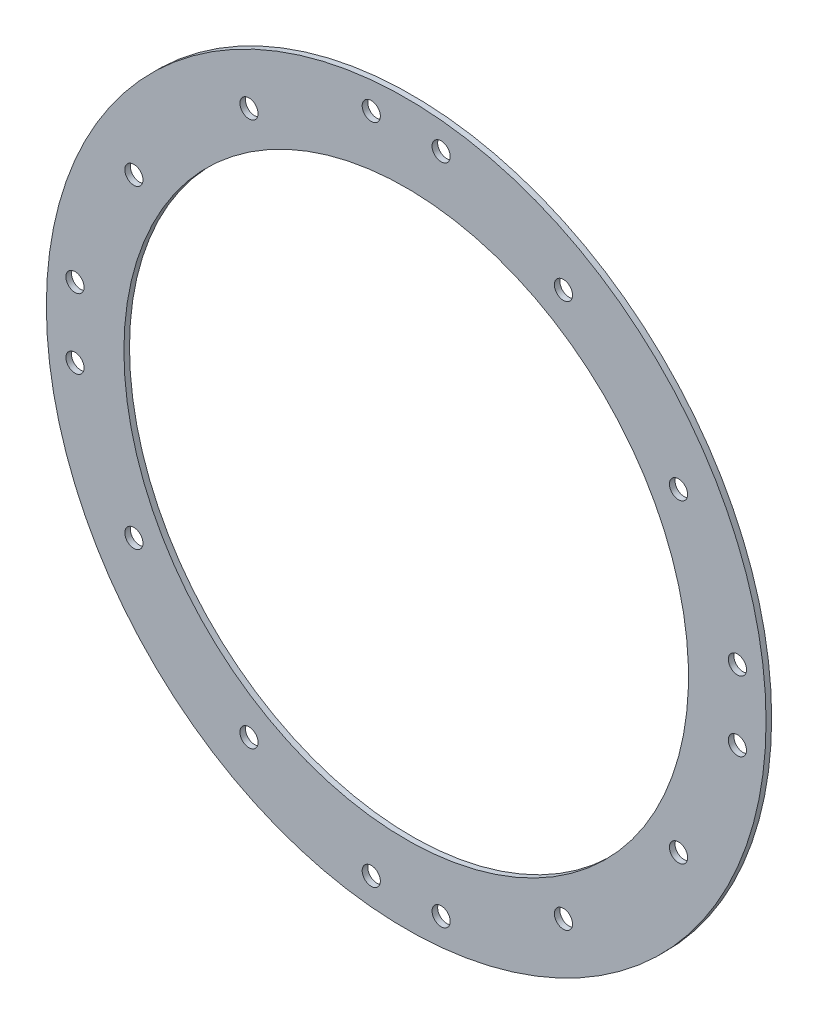
ISO-10303-21;
HEADER;
FILE_DESCRIPTION(('STEP AP214'),'2;1');
FILE_NAME('part.step','',(''),(''),'','','');
FILE_SCHEMA(('AUTOMOTIVE_DESIGN { 1 0 10303 214 1 1 1 1 }'));
ENDSEC;
DATA;
#1=APPLICATION_CONTEXT('core data for automotive mechanical design processes');
#2=APPLICATION_PROTOCOL_DEFINITION('international standard','automotive_design',2000,#1);
#3=PRODUCT_CONTEXT('',#1,'mechanical');
#4=PRODUCT('Part','Part','',(#3));
#5=PRODUCT_RELATED_PRODUCT_CATEGORY('part','',(#4));
#6=PRODUCT_DEFINITION_FORMATION('','',#4);
#7=PRODUCT_DEFINITION_CONTEXT('part definition',#1,'design');
#8=PRODUCT_DEFINITION('design','',#6,#7);
#9=PRODUCT_DEFINITION_SHAPE('','',#8);
#10=(LENGTH_UNIT() NAMED_UNIT(*) SI_UNIT(.MILLI.,.METRE.));
#11=(NAMED_UNIT(*) PLANE_ANGLE_UNIT() SI_UNIT($,.RADIAN.));
#12=(NAMED_UNIT(*) SI_UNIT($,.STERADIAN.) SOLID_ANGLE_UNIT());
#13=UNCERTAINTY_MEASURE_WITH_UNIT(LENGTH_MEASURE(1.E-05),#10,'distance_accuracy_value','');
#14=(GEOMETRIC_REPRESENTATION_CONTEXT(3) GLOBAL_UNCERTAINTY_ASSIGNED_CONTEXT((#13)) GLOBAL_UNIT_ASSIGNED_CONTEXT((#10,
#11,#12)) REPRESENTATION_CONTEXT('',''));
#15=CARTESIAN_POINT('',(0.,0.,0.));
#16=DIRECTION('',(0.,0.,1.));
#17=DIRECTION('',(1.,0.,0.));
#18=AXIS2_PLACEMENT_3D('',#15,#16,#17);
#19=CARTESIAN_POINT('',(0.,0.,-574.));
#20=DIRECTION('',(0.,0.,-1.));
#21=DIRECTION('',(-1.,0.,0.));
#22=AXIS2_PLACEMENT_3D('',#19,#20,#21);
#23=PLANE('',#22);
#24=CARTESIAN_POINT('',(-112.499999999999,194.855715851499,-574.));
#25=DIRECTION('',(0.,0.,-1.));
#26=DIRECTION('',(-1.,0.,0.));
#27=AXIS2_PLACEMENT_3D('',#24,#25,#26);
#28=CIRCLE('',#27,6.50000000000001);
#29=CARTESIAN_POINT('',(-118.999999999999,194.855715851499,-574.));
#30=VERTEX_POINT('',#29);
#31=EDGE_CURVE('E149',#30,#30,#28,.T.);
#32=ORIENTED_EDGE('',*,*,#31,.F.);
#33=EDGE_LOOP('',(#32));
#34=FACE_BOUND('',#33,.T.);
#35=CARTESIAN_POINT('',(-194.855715851499,112.5,-574.));
#36=DIRECTION('',(0.,0.,-1.));
#37=DIRECTION('',(-1.,0.,0.));
#38=AXIS2_PLACEMENT_3D('',#35,#36,#37);
#39=CIRCLE('',#38,6.50000000000001);
#40=CARTESIAN_POINT('',(-201.355715851499,112.5,-574.));
#41=VERTEX_POINT('',#40);
#42=EDGE_CURVE('E143',#41,#41,#39,.T.);
#43=ORIENTED_EDGE('',*,*,#42,.F.);
#44=EDGE_LOOP('',(#43));
#45=FACE_BOUND('',#44,.T.);
#46=CARTESIAN_POINT('',(112.499999999998,194.8557158515,-574.));
#47=DIRECTION('',(0.,0.,-1.));
#48=DIRECTION('',(-1.,0.,0.));
#49=AXIS2_PLACEMENT_3D('',#46,#47,#48);
#50=CIRCLE('',#49,6.50000000000001);
#51=CARTESIAN_POINT('',(105.999999999998,194.8557158515,-574.));
#52=VERTEX_POINT('',#51);
#53=EDGE_CURVE('E137',#52,#52,#50,.T.);
#54=ORIENTED_EDGE('',*,*,#53,.F.);
#55=EDGE_LOOP('',(#54));
#56=FACE_BOUND('',#55,.T.);
#57=CARTESIAN_POINT('',(194.855715851498,112.500000000001,-574.));
#58=DIRECTION('',(0.,0.,-1.));
#59=DIRECTION('',(-1.,0.,0.));
#60=AXIS2_PLACEMENT_3D('',#57,#58,#59);
#61=CIRCLE('',#60,6.50000000000001);
#62=CARTESIAN_POINT('',(188.355715851498,112.500000000001,-574.));
#63=VERTEX_POINT('',#62);
#64=EDGE_CURVE('E131',#63,#63,#61,.T.);
#65=ORIENTED_EDGE('',*,*,#64,.F.);
#66=EDGE_LOOP('',(#65));
#67=FACE_BOUND('',#66,.T.);
#68=CARTESIAN_POINT('',(194.855715851499,-112.499999999999,-574.));
#69=DIRECTION('',(0.,0.,-1.));
#70=DIRECTION('',(-1.,0.,0.));
#71=AXIS2_PLACEMENT_3D('',#68,#69,#70);
#72=CIRCLE('',#71,6.50000000000001);
#73=CARTESIAN_POINT('',(188.355715851499,-112.499999999999,-574.));
#74=VERTEX_POINT('',#73);
#75=EDGE_CURVE('E125',#74,#74,#72,.T.);
#76=ORIENTED_EDGE('',*,*,#75,.F.);
#77=EDGE_LOOP('',(#76));
#78=FACE_BOUND('',#77,.T.);
#79=CARTESIAN_POINT('',(112.500000000001,-194.855715851498,-574.));
#80=DIRECTION('',(0.,0.,-1.));
#81=DIRECTION('',(-1.,0.,0.));
#82=AXIS2_PLACEMENT_3D('',#79,#80,#81);
#83=CIRCLE('',#82,6.50000000000001);
#84=CARTESIAN_POINT('',(106.000000000001,-194.855715851498,-574.));
#85=VERTEX_POINT('',#84);
#86=EDGE_CURVE('E119',#85,#85,#83,.T.);
#87=ORIENTED_EDGE('',*,*,#86,.F.);
#88=EDGE_LOOP('',(#87));
#89=FACE_BOUND('',#88,.T.);
#90=CARTESIAN_POINT('',(-112.5,-194.855715851499,-574.));
#91=DIRECTION('',(0.,0.,-1.));
#92=DIRECTION('',(-1.,0.,0.));
#93=AXIS2_PLACEMENT_3D('',#90,#91,#92);
#94=CIRCLE('',#93,6.50000000000001);
#95=CARTESIAN_POINT('',(-119.,-194.855715851499,-574.));
#96=VERTEX_POINT('',#95);
#97=EDGE_CURVE('E113',#96,#96,#94,.T.);
#98=ORIENTED_EDGE('',*,*,#97,.F.);
#99=EDGE_LOOP('',(#98));
#100=FACE_BOUND('',#99,.T.);
#101=CARTESIAN_POINT('',(-194.855715851499,-112.5,-574.));
#102=DIRECTION('',(0.,0.,-1.));
#103=DIRECTION('',(-1.,0.,0.));
#104=AXIS2_PLACEMENT_3D('',#101,#102,#103);
#105=CIRCLE('',#104,6.50000000000001);
#106=CARTESIAN_POINT('',(-201.355715851499,-112.5,-574.));
#107=VERTEX_POINT('',#106);
#108=EDGE_CURVE('E107',#107,#107,#105,.T.);
#109=ORIENTED_EDGE('',*,*,#108,.F.);
#110=EDGE_LOOP('',(#109));
#111=FACE_BOUND('',#110,.T.);
#112=CARTESIAN_POINT('',(237.,-25.0000000000025,-574.));
#113=DIRECTION('',(0.,0.,1.));
#114=DIRECTION('',(1.,0.,0.));
#115=AXIS2_PLACEMENT_3D('',#112,#113,#114);
#116=CIRCLE('',#115,6.50000000000001);
#117=CARTESIAN_POINT('',(243.5,-25.0000000000025,-574.));
#118=VERTEX_POINT('',#117);
#119=EDGE_CURVE('E98',#118,#118,#116,.T.);
#120=ORIENTED_EDGE('',*,*,#119,.T.);
#121=EDGE_LOOP('',(#120));
#122=FACE_BOUND('',#121,.T.);
#123=CARTESIAN_POINT('',(237.,24.9999999999975,-574.));
#124=DIRECTION('',(0.,0.,1.));
#125=DIRECTION('',(1.,0.,0.));
#126=AXIS2_PLACEMENT_3D('',#123,#124,#125);
#127=CIRCLE('',#126,6.50000000000001);
#128=CARTESIAN_POINT('',(243.5,24.9999999999975,-574.));
#129=VERTEX_POINT('',#128);
#130=EDGE_CURVE('E92',#129,#129,#127,.T.);
#131=ORIENTED_EDGE('',*,*,#130,.T.);
#132=EDGE_LOOP('',(#131));
#133=FACE_BOUND('',#132,.T.);
#134=CARTESIAN_POINT('',(0.,0.,-574.));
#135=DIRECTION('',(0.,0.,-1.));
#136=DIRECTION('',(-1.,0.,0.));
#137=AXIS2_PLACEMENT_3D('',#134,#135,#136);
#138=CIRCLE('',#137,257.5);
#139=CARTESIAN_POINT('',(-257.5,0.,-574.));
#140=VERTEX_POINT('',#139);
#141=EDGE_CURVE('E42',#140,#140,#138,.T.);
#142=ORIENTED_EDGE('',*,*,#141,.T.);
#143=EDGE_LOOP('',(#142));
#144=FACE_BOUND('',#143,.T.);
#145=CARTESIAN_POINT('',(0.,0.,-574.));
#146=DIRECTION('',(0.,0.,-1.));
#147=DIRECTION('',(-1.,0.,0.));
#148=AXIS2_PLACEMENT_3D('',#145,#146,#147);
#149=CIRCLE('',#148,202.);
#150=CARTESIAN_POINT('',(-202.,0.,-574.));
#151=VERTEX_POINT('',#150);
#152=EDGE_CURVE('E51',#151,#151,#149,.T.);
#153=ORIENTED_EDGE('',*,*,#152,.F.);
#154=EDGE_LOOP('',(#153));
#155=FACE_BOUND('',#154,.T.);
#156=CARTESIAN_POINT('',(25.,-237.,-574.));
#157=DIRECTION('',(0.,0.,1.));
#158=DIRECTION('',(1.,0.,0.));
#159=AXIS2_PLACEMENT_3D('',#156,#157,#158);
#160=CIRCLE('',#159,6.5);
#161=CARTESIAN_POINT('',(31.5,-237.,-574.));
#162=VERTEX_POINT('',#161);
#163=EDGE_CURVE('E54',#162,#162,#160,.T.);
#164=ORIENTED_EDGE('',*,*,#163,.T.);
#165=EDGE_LOOP('',(#164));
#166=FACE_BOUND('',#165,.T.);
#167=CARTESIAN_POINT('',(-25.,-237.,-574.));
#168=DIRECTION('',(0.,0.,1.));
#169=DIRECTION('',(1.,0.,0.));
#170=AXIS2_PLACEMENT_3D('',#167,#168,#169);
#171=CIRCLE('',#170,6.5);
#172=CARTESIAN_POINT('',(-18.5,-237.,-574.));
#173=VERTEX_POINT('',#172);
#174=EDGE_CURVE('E62',#173,#173,#171,.T.);
#175=ORIENTED_EDGE('',*,*,#174,.T.);
#176=EDGE_LOOP('',(#175));
#177=FACE_BOUND('',#176,.T.);
#178=CARTESIAN_POINT('',(-237.,-24.9999999999992,-574.));
#179=DIRECTION('',(0.,0.,1.));
#180=DIRECTION('',(1.,0.,0.));
#181=AXIS2_PLACEMENT_3D('',#178,#179,#180);
#182=CIRCLE('',#181,6.50000000000001);
#183=CARTESIAN_POINT('',(-230.5,-24.9999999999992,-574.));
#184=VERTEX_POINT('',#183);
#185=EDGE_CURVE('E68',#184,#184,#182,.T.);
#186=ORIENTED_EDGE('',*,*,#185,.T.);
#187=EDGE_LOOP('',(#186));
#188=FACE_BOUND('',#187,.T.);
#189=CARTESIAN_POINT('',(-237.,25.0000000000008,-574.));
#190=DIRECTION('',(0.,0.,1.));
#191=DIRECTION('',(1.,0.,0.));
#192=AXIS2_PLACEMENT_3D('',#189,#190,#191);
#193=CIRCLE('',#192,6.50000000000001);
#194=CARTESIAN_POINT('',(-230.5,25.0000000000008,-574.));
#195=VERTEX_POINT('',#194);
#196=EDGE_CURVE('E74',#195,#195,#193,.T.);
#197=ORIENTED_EDGE('',*,*,#196,.T.);
#198=EDGE_LOOP('',(#197));
#199=FACE_BOUND('',#198,.T.);
#200=CARTESIAN_POINT('',(-25.,237.,-574.));
#201=DIRECTION('',(0.,0.,1.));
#202=DIRECTION('',(1.,0.,0.));
#203=AXIS2_PLACEMENT_3D('',#200,#201,#202);
#204=CIRCLE('',#203,6.5);
#205=CARTESIAN_POINT('',(-18.5,237.,-574.));
#206=VERTEX_POINT('',#205);
#207=EDGE_CURVE('E80',#206,#206,#204,.T.);
#208=ORIENTED_EDGE('',*,*,#207,.T.);
#209=EDGE_LOOP('',(#208));
#210=FACE_BOUND('',#209,.T.);
#211=CARTESIAN_POINT('',(25.,237.,-574.));
#212=DIRECTION('',(0.,0.,1.));
#213=DIRECTION('',(1.,0.,0.));
#214=AXIS2_PLACEMENT_3D('',#211,#212,#213);
#215=CIRCLE('',#214,6.5);
#216=CARTESIAN_POINT('',(31.5,237.,-574.));
#217=VERTEX_POINT('',#216);
#218=EDGE_CURVE('E86',#217,#217,#215,.T.);
#219=ORIENTED_EDGE('',*,*,#218,.T.);
#220=EDGE_LOOP('',(#219));
#221=FACE_BOUND('',#220,.T.);
#222=ADVANCED_FACE('F38',(#34,#45,#56,#67,#78,#89,#100,#111,#122,#133,#144,#155,#166,#177,#188,
#199,#210,#221),#23,.T.);
#223=CARTESIAN_POINT('',(0.,0.,-570.));
#224=DIRECTION('',(0.,0.,-1.));
#225=DIRECTION('',(-1.,0.,0.));
#226=AXIS2_PLACEMENT_3D('',#223,#224,#225);
#227=CYLINDRICAL_SURFACE('',#226,257.5);
#228=CARTESIAN_POINT('',(0.,0.,-570.));
#229=DIRECTION('',(0.,0.,-1.));
#230=DIRECTION('',(-1.,0.,0.));
#231=AXIS2_PLACEMENT_3D('',#228,#229,#230);
#232=CIRCLE('',#231,257.5);
#233=CARTESIAN_POINT('',(-257.5,0.,-570.));
#234=VERTEX_POINT('',#233);
#235=EDGE_CURVE('E10',#234,#234,#232,.T.);
#236=ORIENTED_EDGE('',*,*,#235,.T.);
#237=EDGE_LOOP('',(#236));
#238=FACE_BOUND('',#237,.T.);
#239=ORIENTED_EDGE('',*,*,#141,.F.);
#240=EDGE_LOOP('',(#239));
#241=FACE_BOUND('',#240,.T.);
#242=ADVANCED_FACE('F40',(#238,#241),#227,.T.);
#243=CARTESIAN_POINT('',(0.,0.,-570.));
#244=DIRECTION('',(0.,0.,-1.));
#245=DIRECTION('',(-1.,0.,0.));
#246=AXIS2_PLACEMENT_3D('',#243,#244,#245);
#247=PLANE('',#246);
#248=CARTESIAN_POINT('',(-112.499999999999,194.855715851499,-570.));
#249=DIRECTION('',(0.,0.,-1.));
#250=DIRECTION('',(-1.,0.,0.));
#251=AXIS2_PLACEMENT_3D('',#248,#249,#250);
#252=CIRCLE('',#251,6.49999999999996);
#253=CARTESIAN_POINT('',(-118.999999999999,194.855715851499,-570.));
#254=VERTEX_POINT('',#253);
#255=EDGE_CURVE('E146',#254,#254,#252,.T.);
#256=ORIENTED_EDGE('',*,*,#255,.T.);
#257=EDGE_LOOP('',(#256));
#258=FACE_BOUND('',#257,.T.);
#259=CARTESIAN_POINT('',(-194.855715851499,112.5,-570.));
#260=DIRECTION('',(0.,0.,-1.));
#261=DIRECTION('',(-1.,0.,0.));
#262=AXIS2_PLACEMENT_3D('',#259,#260,#261);
#263=CIRCLE('',#262,6.49999999999996);
#264=CARTESIAN_POINT('',(-201.355715851499,112.5,-570.));
#265=VERTEX_POINT('',#264);
#266=EDGE_CURVE('E140',#265,#265,#263,.T.);
#267=ORIENTED_EDGE('',*,*,#266,.T.);
#268=EDGE_LOOP('',(#267));
#269=FACE_BOUND('',#268,.T.);
#270=CARTESIAN_POINT('',(112.499999999998,194.8557158515,-570.));
#271=DIRECTION('',(0.,0.,-1.));
#272=DIRECTION('',(-1.,0.,0.));
#273=AXIS2_PLACEMENT_3D('',#270,#271,#272);
#274=CIRCLE('',#273,6.49999999999996);
#275=CARTESIAN_POINT('',(105.999999999998,194.8557158515,-570.));
#276=VERTEX_POINT('',#275);
#277=EDGE_CURVE('E134',#276,#276,#274,.T.);
#278=ORIENTED_EDGE('',*,*,#277,.T.);
#279=EDGE_LOOP('',(#278));
#280=FACE_BOUND('',#279,.T.);
#281=CARTESIAN_POINT('',(194.855715851498,112.500000000001,-570.));
#282=DIRECTION('',(0.,0.,-1.));
#283=DIRECTION('',(-1.,0.,0.));
#284=AXIS2_PLACEMENT_3D('',#281,#282,#283);
#285=CIRCLE('',#284,6.49999999999996);
#286=CARTESIAN_POINT('',(188.355715851498,112.500000000001,-570.));
#287=VERTEX_POINT('',#286);
#288=EDGE_CURVE('E128',#287,#287,#285,.T.);
#289=ORIENTED_EDGE('',*,*,#288,.T.);
#290=EDGE_LOOP('',(#289));
#291=FACE_BOUND('',#290,.T.);
#292=CARTESIAN_POINT('',(194.855715851499,-112.499999999999,-570.));
#293=DIRECTION('',(0.,0.,-1.));
#294=DIRECTION('',(-1.,0.,0.));
#295=AXIS2_PLACEMENT_3D('',#292,#293,#294);
#296=CIRCLE('',#295,6.49999999999996);
#297=CARTESIAN_POINT('',(188.355715851499,-112.499999999999,-570.));
#298=VERTEX_POINT('',#297);
#299=EDGE_CURVE('E122',#298,#298,#296,.T.);
#300=ORIENTED_EDGE('',*,*,#299,.T.);
#301=EDGE_LOOP('',(#300));
#302=FACE_BOUND('',#301,.T.);
#303=CARTESIAN_POINT('',(112.500000000001,-194.855715851498,-570.));
#304=DIRECTION('',(0.,0.,-1.));
#305=DIRECTION('',(-1.,0.,0.));
#306=AXIS2_PLACEMENT_3D('',#303,#304,#305);
#307=CIRCLE('',#306,6.49999999999996);
#308=CARTESIAN_POINT('',(106.000000000001,-194.855715851498,-570.));
#309=VERTEX_POINT('',#308);
#310=EDGE_CURVE('E116',#309,#309,#307,.T.);
#311=ORIENTED_EDGE('',*,*,#310,.T.);
#312=EDGE_LOOP('',(#311));
#313=FACE_BOUND('',#312,.T.);
#314=CARTESIAN_POINT('',(-112.5,-194.855715851499,-570.));
#315=DIRECTION('',(0.,0.,-1.));
#316=DIRECTION('',(-1.,0.,0.));
#317=AXIS2_PLACEMENT_3D('',#314,#315,#316);
#318=CIRCLE('',#317,6.49999999999996);
#319=CARTESIAN_POINT('',(-119.,-194.855715851499,-570.));
#320=VERTEX_POINT('',#319);
#321=EDGE_CURVE('E110',#320,#320,#318,.T.);
#322=ORIENTED_EDGE('',*,*,#321,.T.);
#323=EDGE_LOOP('',(#322));
#324=FACE_BOUND('',#323,.T.);
#325=CARTESIAN_POINT('',(-194.855715851499,-112.5,-570.));
#326=DIRECTION('',(0.,0.,-1.));
#327=DIRECTION('',(-1.,0.,0.));
#328=AXIS2_PLACEMENT_3D('',#325,#326,#327);
#329=CIRCLE('',#328,6.49999999999996);
#330=CARTESIAN_POINT('',(-201.355715851499,-112.5,-570.));
#331=VERTEX_POINT('',#330);
#332=EDGE_CURVE('E104',#331,#331,#329,.T.);
#333=ORIENTED_EDGE('',*,*,#332,.T.);
#334=EDGE_LOOP('',(#333));
#335=FACE_BOUND('',#334,.T.);
#336=CARTESIAN_POINT('',(237.,-25.0000000000025,-570.));
#337=DIRECTION('',(0.,0.,1.));
#338=DIRECTION('',(1.,0.,0.));
#339=AXIS2_PLACEMENT_3D('',#336,#337,#338);
#340=CIRCLE('',#339,6.50000000000001);
#341=CARTESIAN_POINT('',(243.5,-25.0000000000025,-570.));
#342=VERTEX_POINT('',#341);
#343=EDGE_CURVE('E101',#342,#342,#340,.T.);
#344=ORIENTED_EDGE('',*,*,#343,.F.);
#345=EDGE_LOOP('',(#344));
#346=FACE_BOUND('',#345,.T.);
#347=CARTESIAN_POINT('',(237.,24.9999999999975,-570.));
#348=DIRECTION('',(0.,0.,1.));
#349=DIRECTION('',(1.,0.,0.));
#350=AXIS2_PLACEMENT_3D('',#347,#348,#349);
#351=CIRCLE('',#350,6.50000000000001);
#352=CARTESIAN_POINT('',(243.5,24.9999999999975,-570.));
#353=VERTEX_POINT('',#352);
#354=EDGE_CURVE('E95',#353,#353,#351,.T.);
#355=ORIENTED_EDGE('',*,*,#354,.F.);
#356=EDGE_LOOP('',(#355));
#357=FACE_BOUND('',#356,.T.);
#358=CARTESIAN_POINT('',(25.,237.,-570.));
#359=DIRECTION('',(0.,0.,1.));
#360=DIRECTION('',(1.,0.,0.));
#361=AXIS2_PLACEMENT_3D('',#358,#359,#360);
#362=CIRCLE('',#361,6.5);
#363=CARTESIAN_POINT('',(31.5,237.,-570.));
#364=VERTEX_POINT('',#363);
#365=EDGE_CURVE('E89',#364,#364,#362,.T.);
#366=ORIENTED_EDGE('',*,*,#365,.F.);
#367=EDGE_LOOP('',(#366));
#368=FACE_BOUND('',#367,.T.);
#369=CARTESIAN_POINT('',(-25.,237.,-570.));
#370=DIRECTION('',(0.,0.,1.));
#371=DIRECTION('',(1.,0.,0.));
#372=AXIS2_PLACEMENT_3D('',#369,#370,#371);
#373=CIRCLE('',#372,6.5);
#374=CARTESIAN_POINT('',(-18.5,237.,-570.));
#375=VERTEX_POINT('',#374);
#376=EDGE_CURVE('E83',#375,#375,#373,.T.);
#377=ORIENTED_EDGE('',*,*,#376,.F.);
#378=EDGE_LOOP('',(#377));
#379=FACE_BOUND('',#378,.T.);
#380=CARTESIAN_POINT('',(-237.,25.0000000000008,-570.));
#381=DIRECTION('',(0.,0.,1.));
#382=DIRECTION('',(1.,0.,0.));
#383=AXIS2_PLACEMENT_3D('',#380,#381,#382);
#384=CIRCLE('',#383,6.50000000000001);
#385=CARTESIAN_POINT('',(-230.5,25.0000000000008,-570.));
#386=VERTEX_POINT('',#385);
#387=EDGE_CURVE('E77',#386,#386,#384,.T.);
#388=ORIENTED_EDGE('',*,*,#387,.F.);
#389=EDGE_LOOP('',(#388));
#390=FACE_BOUND('',#389,.T.);
#391=CARTESIAN_POINT('',(-237.,-24.9999999999992,-570.));
#392=DIRECTION('',(0.,0.,1.));
#393=DIRECTION('',(1.,0.,0.));
#394=AXIS2_PLACEMENT_3D('',#391,#392,#393);
#395=CIRCLE('',#394,6.50000000000001);
#396=CARTESIAN_POINT('',(-230.5,-24.9999999999992,-570.));
#397=VERTEX_POINT('',#396);
#398=EDGE_CURVE('E71',#397,#397,#395,.T.);
#399=ORIENTED_EDGE('',*,*,#398,.F.);
#400=EDGE_LOOP('',(#399));
#401=FACE_BOUND('',#400,.T.);
#402=CARTESIAN_POINT('',(-25.,-237.,-570.));
#403=DIRECTION('',(0.,0.,1.));
#404=DIRECTION('',(1.,0.,0.));
#405=AXIS2_PLACEMENT_3D('',#402,#403,#404);
#406=CIRCLE('',#405,6.5);
#407=CARTESIAN_POINT('',(-18.5,-237.,-570.));
#408=VERTEX_POINT('',#407);
#409=EDGE_CURVE('E65',#408,#408,#406,.T.);
#410=ORIENTED_EDGE('',*,*,#409,.F.);
#411=EDGE_LOOP('',(#410));
#412=FACE_BOUND('',#411,.T.);
#413=CARTESIAN_POINT('',(25.,-237.,-570.));
#414=DIRECTION('',(0.,0.,1.));
#415=DIRECTION('',(1.,0.,0.));
#416=AXIS2_PLACEMENT_3D('',#413,#414,#415);
#417=CIRCLE('',#416,6.5);
#418=CARTESIAN_POINT('',(31.5,-237.,-570.));
#419=VERTEX_POINT('',#418);
#420=EDGE_CURVE('E59',#419,#419,#417,.T.);
#421=ORIENTED_EDGE('',*,*,#420,.F.);
#422=EDGE_LOOP('',(#421));
#423=FACE_BOUND('',#422,.T.);
#424=CARTESIAN_POINT('',(0.,0.,-570.));
#425=DIRECTION('',(0.,0.,-1.));
#426=DIRECTION('',(-1.,0.,0.));
#427=AXIS2_PLACEMENT_3D('',#424,#425,#426);
#428=CIRCLE('',#427,202.);
#429=CARTESIAN_POINT('',(-202.,0.,-570.));
#430=VERTEX_POINT('',#429);
#431=EDGE_CURVE('E49',#430,#430,#428,.T.);
#432=ORIENTED_EDGE('',*,*,#431,.T.);
#433=EDGE_LOOP('',(#432));
#434=FACE_BOUND('',#433,.T.);
#435=ORIENTED_EDGE('',*,*,#235,.F.);
#436=EDGE_LOOP('',(#435));
#437=FACE_BOUND('',#436,.T.);
#438=ADVANCED_FACE('F199',(#258,#269,#280,#291,#302,#313,#324,#335,#346,#357,#368,#379,#390,
#401,#412,#423,#434,#437),#247,.F.);
#439=CARTESIAN_POINT('',(0.,0.,-570.));
#440=DIRECTION('',(0.,0.,-1.));
#441=DIRECTION('',(-1.,0.,0.));
#442=AXIS2_PLACEMENT_3D('',#439,#440,#441);
#443=CYLINDRICAL_SURFACE('',#442,202.);
#444=ORIENTED_EDGE('',*,*,#431,.F.);
#445=EDGE_LOOP('',(#444));
#446=FACE_BOUND('',#445,.T.);
#447=ORIENTED_EDGE('',*,*,#152,.T.);
#448=EDGE_LOOP('',(#447));
#449=FACE_BOUND('',#448,.T.);
#450=ADVANCED_FACE('F202',(#446,#449),#443,.F.);
#451=CARTESIAN_POINT('',(25.,-237.,-570.));
#452=DIRECTION('',(0.,0.,1.));
#453=DIRECTION('',(1.,0.,0.));
#454=AXIS2_PLACEMENT_3D('',#451,#452,#453);
#455=CYLINDRICAL_SURFACE('',#454,6.5);
#456=ORIENTED_EDGE('',*,*,#163,.F.);
#457=EDGE_LOOP('',(#456));
#458=FACE_BOUND('',#457,.T.);
#459=ORIENTED_EDGE('',*,*,#420,.T.);
#460=EDGE_LOOP('',(#459));
#461=FACE_BOUND('',#460,.T.);
#462=ADVANCED_FACE('F220',(#458,#461),#455,.F.);
#463=CARTESIAN_POINT('',(-25.,-237.,-570.));
#464=DIRECTION('',(0.,0.,1.));
#465=DIRECTION('',(1.,0.,0.));
#466=AXIS2_PLACEMENT_3D('',#463,#464,#465);
#467=CYLINDRICAL_SURFACE('',#466,6.5);
#468=ORIENTED_EDGE('',*,*,#174,.F.);
#469=EDGE_LOOP('',(#468));
#470=FACE_BOUND('',#469,.T.);
#471=ORIENTED_EDGE('',*,*,#409,.T.);
#472=EDGE_LOOP('',(#471));
#473=FACE_BOUND('',#472,.T.);
#474=ADVANCED_FACE('F225',(#470,#473),#467,.F.);
#475=CARTESIAN_POINT('',(-237.,-24.9999999999992,-570.));
#476=DIRECTION('',(0.,0.,1.));
#477=DIRECTION('',(1.,0.,0.));
#478=AXIS2_PLACEMENT_3D('',#475,#476,#477);
#479=CYLINDRICAL_SURFACE('',#478,6.50000000000001);
#480=ORIENTED_EDGE('',*,*,#185,.F.);
#481=EDGE_LOOP('',(#480));
#482=FACE_BOUND('',#481,.T.);
#483=ORIENTED_EDGE('',*,*,#398,.T.);
#484=EDGE_LOOP('',(#483));
#485=FACE_BOUND('',#484,.T.);
#486=ADVANCED_FACE('F231',(#482,#485),#479,.F.);
#487=CARTESIAN_POINT('',(-237.,25.0000000000008,-570.));
#488=DIRECTION('',(0.,0.,1.));
#489=DIRECTION('',(1.,0.,0.));
#490=AXIS2_PLACEMENT_3D('',#487,#488,#489);
#491=CYLINDRICAL_SURFACE('',#490,6.50000000000001);
#492=ORIENTED_EDGE('',*,*,#196,.F.);
#493=EDGE_LOOP('',(#492));
#494=FACE_BOUND('',#493,.T.);
#495=ORIENTED_EDGE('',*,*,#387,.T.);
#496=EDGE_LOOP('',(#495));
#497=FACE_BOUND('',#496,.T.);
#498=ADVANCED_FACE('F235',(#494,#497),#491,.F.);
#499=CARTESIAN_POINT('',(-25.,237.,-570.));
#500=DIRECTION('',(0.,0.,1.));
#501=DIRECTION('',(1.,0.,0.));
#502=AXIS2_PLACEMENT_3D('',#499,#500,#501);
#503=CYLINDRICAL_SURFACE('',#502,6.5);
#504=ORIENTED_EDGE('',*,*,#207,.F.);
#505=EDGE_LOOP('',(#504));
#506=FACE_BOUND('',#505,.T.);
#507=ORIENTED_EDGE('',*,*,#376,.T.);
#508=EDGE_LOOP('',(#507));
#509=FACE_BOUND('',#508,.T.);
#510=ADVANCED_FACE('F195',(#506,#509),#503,.F.);
#511=CARTESIAN_POINT('',(25.,237.,-570.));
#512=DIRECTION('',(0.,0.,1.));
#513=DIRECTION('',(1.,0.,0.));
#514=AXIS2_PLACEMENT_3D('',#511,#512,#513);
#515=CYLINDRICAL_SURFACE('',#514,6.5);
#516=ORIENTED_EDGE('',*,*,#218,.F.);
#517=EDGE_LOOP('',(#516));
#518=FACE_BOUND('',#517,.T.);
#519=ORIENTED_EDGE('',*,*,#365,.T.);
#520=EDGE_LOOP('',(#519));
#521=FACE_BOUND('',#520,.T.);
#522=ADVANCED_FACE('F191',(#518,#521),#515,.F.);
#523=CARTESIAN_POINT('',(237.,24.9999999999975,-570.));
#524=DIRECTION('',(0.,0.,1.));
#525=DIRECTION('',(1.,0.,0.));
#526=AXIS2_PLACEMENT_3D('',#523,#524,#525);
#527=CYLINDRICAL_SURFACE('',#526,6.50000000000001);
#528=ORIENTED_EDGE('',*,*,#130,.F.);
#529=EDGE_LOOP('',(#528));
#530=FACE_BOUND('',#529,.T.);
#531=ORIENTED_EDGE('',*,*,#354,.T.);
#532=EDGE_LOOP('',(#531));
#533=FACE_BOUND('',#532,.T.);
#534=ADVANCED_FACE('F194',(#530,#533),#527,.F.);
#535=CARTESIAN_POINT('',(237.,-25.0000000000025,-570.));
#536=DIRECTION('',(0.,0.,1.));
#537=DIRECTION('',(1.,0.,0.));
#538=AXIS2_PLACEMENT_3D('',#535,#536,#537);
#539=CYLINDRICAL_SURFACE('',#538,6.50000000000001);
#540=ORIENTED_EDGE('',*,*,#119,.F.);
#541=EDGE_LOOP('',(#540));
#542=FACE_BOUND('',#541,.T.);
#543=ORIENTED_EDGE('',*,*,#343,.T.);
#544=EDGE_LOOP('',(#543));
#545=FACE_BOUND('',#544,.T.);
#546=ADVANCED_FACE('F245',(#542,#545),#539,.F.);
#547=CARTESIAN_POINT('',(-194.855715851499,-112.5,-574.));
#548=DIRECTION('',(0.,0.,-1.));
#549=DIRECTION('',(-1.,0.,0.));
#550=AXIS2_PLACEMENT_3D('',#547,#548,#549);
#551=CYLINDRICAL_SURFACE('',#550,6.49999999999996);
#552=ORIENTED_EDGE('',*,*,#332,.F.);
#553=EDGE_LOOP('',(#552));
#554=FACE_BOUND('',#553,.T.);
#555=ORIENTED_EDGE('',*,*,#108,.T.);
#556=EDGE_LOOP('',(#555));
#557=FACE_BOUND('',#556,.T.);
#558=ADVANCED_FACE('F249',(#554,#557),#551,.F.);
#559=CARTESIAN_POINT('',(-112.5,-194.855715851499,-574.));
#560=DIRECTION('',(0.,0.,-1.));
#561=DIRECTION('',(-1.,0.,0.));
#562=AXIS2_PLACEMENT_3D('',#559,#560,#561);
#563=CYLINDRICAL_SURFACE('',#562,6.49999999999996);
#564=ORIENTED_EDGE('',*,*,#321,.F.);
#565=EDGE_LOOP('',(#564));
#566=FACE_BOUND('',#565,.T.);
#567=ORIENTED_EDGE('',*,*,#97,.T.);
#568=EDGE_LOOP('',(#567));
#569=FACE_BOUND('',#568,.T.);
#570=ADVANCED_FACE('F253',(#566,#569),#563,.F.);
#571=CARTESIAN_POINT('',(112.500000000001,-194.855715851498,-574.));
#572=DIRECTION('',(0.,0.,-1.));
#573=DIRECTION('',(-1.,0.,0.));
#574=AXIS2_PLACEMENT_3D('',#571,#572,#573);
#575=CYLINDRICAL_SURFACE('',#574,6.49999999999996);
#576=ORIENTED_EDGE('',*,*,#310,.F.);
#577=EDGE_LOOP('',(#576));
#578=FACE_BOUND('',#577,.T.);
#579=ORIENTED_EDGE('',*,*,#86,.T.);
#580=EDGE_LOOP('',(#579));
#581=FACE_BOUND('',#580,.T.);
#582=ADVANCED_FACE('F257',(#578,#581),#575,.F.);
#583=CARTESIAN_POINT('',(194.855715851499,-112.499999999999,-574.));
#584=DIRECTION('',(0.,0.,-1.));
#585=DIRECTION('',(-1.,0.,0.));
#586=AXIS2_PLACEMENT_3D('',#583,#584,#585);
#587=CYLINDRICAL_SURFACE('',#586,6.49999999999996);
#588=ORIENTED_EDGE('',*,*,#299,.F.);
#589=EDGE_LOOP('',(#588));
#590=FACE_BOUND('',#589,.T.);
#591=ORIENTED_EDGE('',*,*,#75,.T.);
#592=EDGE_LOOP('',(#591));
#593=FACE_BOUND('',#592,.T.);
#594=ADVANCED_FACE('F261',(#590,#593),#587,.F.);
#595=CARTESIAN_POINT('',(194.855715851498,112.500000000001,-574.));
#596=DIRECTION('',(0.,0.,-1.));
#597=DIRECTION('',(-1.,0.,0.));
#598=AXIS2_PLACEMENT_3D('',#595,#596,#597);
#599=CYLINDRICAL_SURFACE('',#598,6.49999999999996);
#600=ORIENTED_EDGE('',*,*,#288,.F.);
#601=EDGE_LOOP('',(#600));
#602=FACE_BOUND('',#601,.T.);
#603=ORIENTED_EDGE('',*,*,#64,.T.);
#604=EDGE_LOOP('',(#603));
#605=FACE_BOUND('',#604,.T.);
#606=ADVANCED_FACE('F265',(#602,#605),#599,.F.);
#607=CARTESIAN_POINT('',(112.499999999998,194.8557158515,-574.));
#608=DIRECTION('',(0.,0.,-1.));
#609=DIRECTION('',(-1.,0.,0.));
#610=AXIS2_PLACEMENT_3D('',#607,#608,#609);
#611=CYLINDRICAL_SURFACE('',#610,6.49999999999996);
#612=ORIENTED_EDGE('',*,*,#277,.F.);
#613=EDGE_LOOP('',(#612));
#614=FACE_BOUND('',#613,.T.);
#615=ORIENTED_EDGE('',*,*,#53,.T.);
#616=EDGE_LOOP('',(#615));
#617=FACE_BOUND('',#616,.T.);
#618=ADVANCED_FACE('F269',(#614,#617),#611,.F.);
#619=CARTESIAN_POINT('',(-194.855715851499,112.5,-574.));
#620=DIRECTION('',(0.,0.,-1.));
#621=DIRECTION('',(-1.,0.,0.));
#622=AXIS2_PLACEMENT_3D('',#619,#620,#621);
#623=CYLINDRICAL_SURFACE('',#622,6.49999999999996);
#624=ORIENTED_EDGE('',*,*,#266,.F.);
#625=EDGE_LOOP('',(#624));
#626=FACE_BOUND('',#625,.T.);
#627=ORIENTED_EDGE('',*,*,#42,.T.);
#628=EDGE_LOOP('',(#627));
#629=FACE_BOUND('',#628,.T.);
#630=ADVANCED_FACE('F273',(#626,#629),#623,.F.);
#631=CARTESIAN_POINT('',(-112.499999999999,194.855715851499,-574.));
#632=DIRECTION('',(0.,0.,-1.));
#633=DIRECTION('',(-1.,0.,0.));
#634=AXIS2_PLACEMENT_3D('',#631,#632,#633);
#635=CYLINDRICAL_SURFACE('',#634,6.49999999999996);
#636=ORIENTED_EDGE('',*,*,#255,.F.);
#637=EDGE_LOOP('',(#636));
#638=FACE_BOUND('',#637,.T.);
#639=ORIENTED_EDGE('',*,*,#31,.T.);
#640=EDGE_LOOP('',(#639));
#641=FACE_BOUND('',#640,.T.);
#642=ADVANCED_FACE('F153',(#638,#641),#635,.F.);
#643=CLOSED_SHELL('',(#222,#242,#438,#450,#462,#474,#486,#498,#510,#522,#534,#546,#558,#570,
#582,#594,#606,#618,#630,#642));
#644=MANIFOLD_SOLID_BREP('B2',#643);
#645=ADVANCED_BREP_SHAPE_REPRESENTATION('',(#18,#644),#14);
#646=SHAPE_DEFINITION_REPRESENTATION(#9,#645);
ENDSEC;
END-ISO-10303-21;
